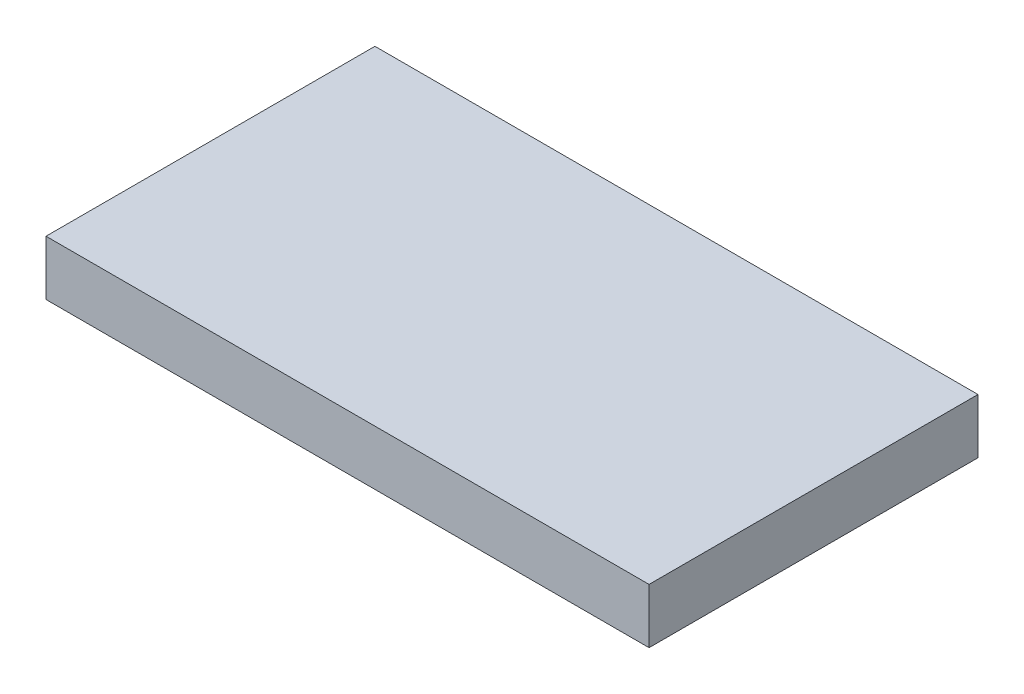
ISO-10303-21;
HEADER;
FILE_DESCRIPTION(('STEP AP214'),'2;1');
FILE_NAME('part.step','',(''),(''),'','','');
FILE_SCHEMA(('AUTOMOTIVE_DESIGN { 1 0 10303 214 1 1 1 1 }'));
ENDSEC;
DATA;
#1=APPLICATION_CONTEXT('core data for automotive mechanical design processes');
#2=APPLICATION_PROTOCOL_DEFINITION('international standard','automotive_design',2000,#1);
#3=PRODUCT_CONTEXT('',#1,'mechanical');
#4=PRODUCT('Part','Part','',(#3));
#5=PRODUCT_RELATED_PRODUCT_CATEGORY('part','',(#4));
#6=PRODUCT_DEFINITION_FORMATION('','',#4);
#7=PRODUCT_DEFINITION_CONTEXT('part definition',#1,'design');
#8=PRODUCT_DEFINITION('design','',#6,#7);
#9=PRODUCT_DEFINITION_SHAPE('','',#8);
#10=(LENGTH_UNIT() NAMED_UNIT(*) SI_UNIT(.MILLI.,.METRE.));
#11=(NAMED_UNIT(*) PLANE_ANGLE_UNIT() SI_UNIT($,.RADIAN.));
#12=(NAMED_UNIT(*) SI_UNIT($,.STERADIAN.) SOLID_ANGLE_UNIT());
#13=UNCERTAINTY_MEASURE_WITH_UNIT(LENGTH_MEASURE(1.E-05),#10,'distance_accuracy_value','');
#14=(GEOMETRIC_REPRESENTATION_CONTEXT(3) GLOBAL_UNCERTAINTY_ASSIGNED_CONTEXT((#13)) GLOBAL_UNIT_ASSIGNED_CONTEXT((#10,
#11,#12)) REPRESENTATION_CONTEXT('',''));
#15=CARTESIAN_POINT('',(0.,0.,0.));
#16=DIRECTION('',(0.,0.,1.));
#17=DIRECTION('',(1.,0.,0.));
#18=AXIS2_PLACEMENT_3D('',#15,#16,#17);
#19=CARTESIAN_POINT('',(0.,10.,0.));
#20=DIRECTION('',(1.,0.,0.));
#21=DIRECTION('',(0.,0.,-1.));
#22=AXIS2_PLACEMENT_3D('',#19,#20,#21);
#23=PLANE('',#22);
#24=DIRECTION('',(0.,0.,1.));
#25=VECTOR('',#24,1.);
#26=CARTESIAN_POINT('',(0.,0.,0.));
#27=LINE('',#26,#25);
#28=CARTESIAN_POINT('',(0.,0.,-60.));
#29=VERTEX_POINT('',#28);
#30=CARTESIAN_POINT('',(0.,0.,0.));
#31=VERTEX_POINT('',#30);
#32=EDGE_CURVE('E96',#29,#31,#27,.T.);
#33=ORIENTED_EDGE('',*,*,#32,.T.);
#34=DIRECTION('',(0.,-1.,0.));
#35=VECTOR('',#34,1.);
#36=CARTESIAN_POINT('',(0.,10.,0.));
#37=LINE('',#36,#35);
#38=CARTESIAN_POINT('',(0.,10.,0.));
#39=VERTEX_POINT('',#38);
#40=EDGE_CURVE('E11',#39,#31,#37,.T.);
#41=ORIENTED_EDGE('',*,*,#40,.F.);
#42=DIRECTION('',(0.,0.,1.));
#43=VECTOR('',#42,1.);
#44=CARTESIAN_POINT('',(0.,10.,0.));
#45=LINE('',#44,#43);
#46=CARTESIAN_POINT('',(0.,10.,-60.));
#47=VERTEX_POINT('',#46);
#48=EDGE_CURVE('E84',#47,#39,#45,.T.);
#49=ORIENTED_EDGE('',*,*,#48,.F.);
#50=DIRECTION('',(0.,-1.,0.));
#51=VECTOR('',#50,1.);
#52=CARTESIAN_POINT('',(0.,10.,-60.));
#53=LINE('',#52,#51);
#54=EDGE_CURVE('E92',#47,#29,#53,.T.);
#55=ORIENTED_EDGE('',*,*,#54,.T.);
#56=EDGE_LOOP('',(#33,#41,#49,#55));
#57=FACE_BOUND('',#56,.T.);
#58=ADVANCED_FACE('F33',(#57),#23,.F.);
#59=CARTESIAN_POINT('',(0.,10.,0.));
#60=DIRECTION('',(0.,0.,-1.));
#61=DIRECTION('',(-1.,0.,0.));
#62=AXIS2_PLACEMENT_3D('',#59,#60,#61);
#63=PLANE('',#62);
#64=DIRECTION('',(1.,0.,0.));
#65=VECTOR('',#64,1.);
#66=CARTESIAN_POINT('',(0.,0.,0.));
#67=LINE('',#66,#65);
#68=CARTESIAN_POINT('',(110.,0.,0.));
#69=VERTEX_POINT('',#68);
#70=EDGE_CURVE('E88',#31,#69,#67,.T.);
#71=ORIENTED_EDGE('',*,*,#70,.T.);
#72=DIRECTION('',(0.,-1.,0.));
#73=VECTOR('',#72,1.);
#74=CARTESIAN_POINT('',(110.,10.,0.));
#75=LINE('',#74,#73);
#76=CARTESIAN_POINT('',(110.,10.,0.));
#77=VERTEX_POINT('',#76);
#78=EDGE_CURVE('E41',#77,#69,#75,.T.);
#79=ORIENTED_EDGE('',*,*,#78,.F.);
#80=DIRECTION('',(1.,0.,0.));
#81=VECTOR('',#80,1.);
#82=CARTESIAN_POINT('',(0.,10.,0.));
#83=LINE('',#82,#81);
#84=EDGE_CURVE('E79',#39,#77,#83,.T.);
#85=ORIENTED_EDGE('',*,*,#84,.F.);
#86=ORIENTED_EDGE('',*,*,#40,.T.);
#87=EDGE_LOOP('',(#71,#79,#85,#86));
#88=FACE_BOUND('',#87,.T.);
#89=ADVANCED_FACE('F87',(#88),#63,.F.);
#90=CARTESIAN_POINT('',(110.,10.,0.));
#91=DIRECTION('',(-1.,0.,0.));
#92=DIRECTION('',(0.,0.,1.));
#93=AXIS2_PLACEMENT_3D('',#90,#91,#92);
#94=PLANE('',#93);
#95=DIRECTION('',(0.,0.,-1.));
#96=VECTOR('',#95,1.);
#97=CARTESIAN_POINT('',(110.,0.,0.));
#98=LINE('',#97,#96);
#99=CARTESIAN_POINT('',(110.,0.,-60.));
#100=VERTEX_POINT('',#99);
#101=EDGE_CURVE('E66',#69,#100,#98,.T.);
#102=ORIENTED_EDGE('',*,*,#101,.T.);
#103=DIRECTION('',(0.,-1.,0.));
#104=VECTOR('',#103,1.);
#105=CARTESIAN_POINT('',(110.,10.,-60.));
#106=LINE('',#105,#104);
#107=CARTESIAN_POINT('',(110.,10.,-60.));
#108=VERTEX_POINT('',#107);
#109=EDGE_CURVE('E89',#108,#100,#106,.T.);
#110=ORIENTED_EDGE('',*,*,#109,.F.);
#111=DIRECTION('',(0.,0.,-1.));
#112=VECTOR('',#111,1.);
#113=CARTESIAN_POINT('',(110.,10.,0.));
#114=LINE('',#113,#112);
#115=EDGE_CURVE('E82',#77,#108,#114,.T.);
#116=ORIENTED_EDGE('',*,*,#115,.F.);
#117=ORIENTED_EDGE('',*,*,#78,.T.);
#118=EDGE_LOOP('',(#102,#110,#116,#117));
#119=FACE_BOUND('',#118,.T.);
#120=ADVANCED_FACE('F90',(#119),#94,.F.);
#121=CARTESIAN_POINT('',(0.,10.,-60.));
#122=DIRECTION('',(0.,0.,1.));
#123=DIRECTION('',(1.,0.,0.));
#124=AXIS2_PLACEMENT_3D('',#121,#122,#123);
#125=PLANE('',#124);
#126=DIRECTION('',(-1.,0.,0.));
#127=VECTOR('',#126,1.);
#128=CARTESIAN_POINT('',(0.,0.,-60.));
#129=LINE('',#128,#127);
#130=EDGE_CURVE('E72',#100,#29,#129,.T.);
#131=ORIENTED_EDGE('',*,*,#130,.T.);
#132=ORIENTED_EDGE('',*,*,#54,.F.);
#133=DIRECTION('',(-1.,0.,0.));
#134=VECTOR('',#133,1.);
#135=CARTESIAN_POINT('',(0.,10.,-60.));
#136=LINE('',#135,#134);
#137=EDGE_CURVE('E49',#108,#47,#136,.T.);
#138=ORIENTED_EDGE('',*,*,#137,.F.);
#139=ORIENTED_EDGE('',*,*,#109,.T.);
#140=EDGE_LOOP('',(#131,#132,#138,#139));
#141=FACE_BOUND('',#140,.T.);
#142=ADVANCED_FACE('F103',(#141),#125,.F.);
#143=CARTESIAN_POINT('',(0.,10.,0.));
#144=DIRECTION('',(0.,-1.,0.));
#145=DIRECTION('',(0.,0.,-1.));
#146=AXIS2_PLACEMENT_3D('',#143,#144,#145);
#147=PLANE('',#146);
#148=ORIENTED_EDGE('',*,*,#48,.T.);
#149=ORIENTED_EDGE('',*,*,#84,.T.);
#150=ORIENTED_EDGE('',*,*,#115,.T.);
#151=ORIENTED_EDGE('',*,*,#137,.T.);
#152=EDGE_LOOP('',(#148,#149,#150,#151));
#153=FACE_BOUND('',#152,.T.);
#154=ADVANCED_FACE('F80',(#153),#147,.F.);
#155=CARTESIAN_POINT('',(0.,0.,0.));
#156=DIRECTION('',(0.,-1.,0.));
#157=DIRECTION('',(0.,0.,-1.));
#158=AXIS2_PLACEMENT_3D('',#155,#156,#157);
#159=PLANE('',#158);
#160=ORIENTED_EDGE('',*,*,#32,.F.);
#161=ORIENTED_EDGE('',*,*,#130,.F.);
#162=ORIENTED_EDGE('',*,*,#101,.F.);
#163=ORIENTED_EDGE('',*,*,#70,.F.);
#164=EDGE_LOOP('',(#160,#161,#162,#163));
#165=FACE_BOUND('',#164,.T.);
#166=ADVANCED_FACE('F106',(#165),#159,.T.);
#167=CLOSED_SHELL('',(#58,#89,#120,#142,#154,#166));
#168=MANIFOLD_SOLID_BREP('B2',#167);
#169=ADVANCED_BREP_SHAPE_REPRESENTATION('',(#18,#168),#14);
#170=SHAPE_DEFINITION_REPRESENTATION(#9,#169);
ENDSEC;
END-ISO-10303-21;
